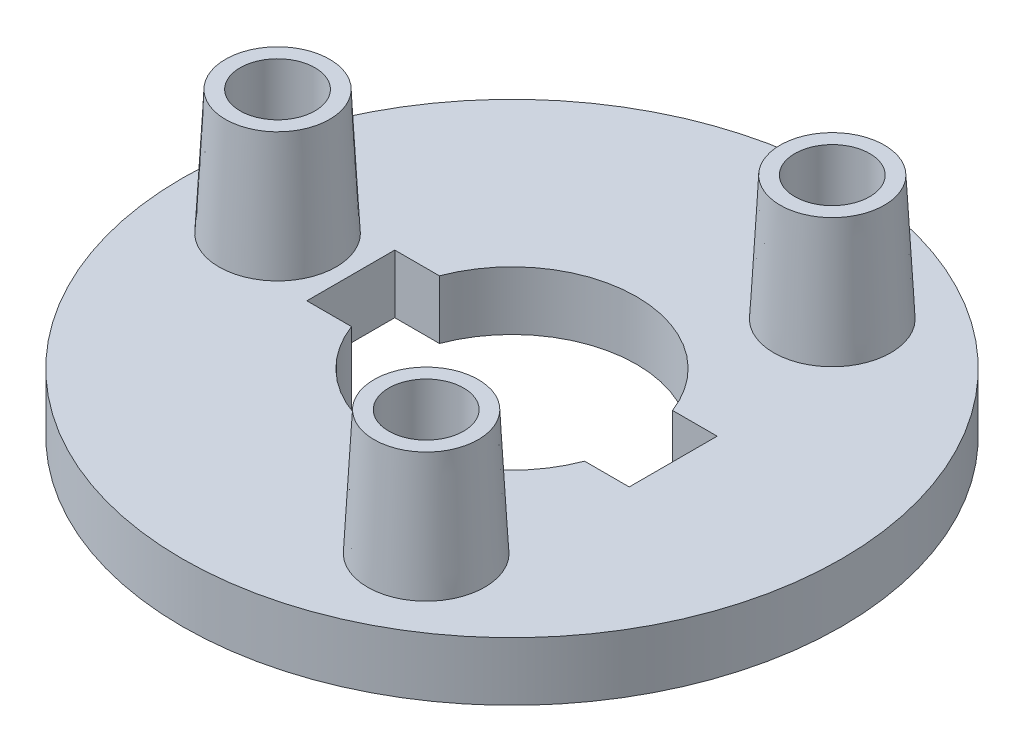
ISO-10303-21;
HEADER;
FILE_DESCRIPTION(('STEP AP214'),'2;1');
FILE_NAME('part.step','',(''),(''),'','','');
FILE_SCHEMA(('AUTOMOTIVE_DESIGN { 1 0 10303 214 1 1 1 1 }'));
ENDSEC;
DATA;
#1=APPLICATION_CONTEXT('core data for automotive mechanical design processes');
#2=APPLICATION_PROTOCOL_DEFINITION('international standard','automotive_design',2000,#1);
#3=PRODUCT_CONTEXT('',#1,'mechanical');
#4=PRODUCT('Part','Part','',(#3));
#5=PRODUCT_RELATED_PRODUCT_CATEGORY('part','',(#4));
#6=PRODUCT_DEFINITION_FORMATION('','',#4);
#7=PRODUCT_DEFINITION_CONTEXT('part definition',#1,'design');
#8=PRODUCT_DEFINITION('design','',#6,#7);
#9=PRODUCT_DEFINITION_SHAPE('','',#8);
#10=(LENGTH_UNIT() NAMED_UNIT(*) SI_UNIT(.MILLI.,.METRE.));
#11=(NAMED_UNIT(*) PLANE_ANGLE_UNIT() SI_UNIT($,.RADIAN.));
#12=(NAMED_UNIT(*) SI_UNIT($,.STERADIAN.) SOLID_ANGLE_UNIT());
#13=UNCERTAINTY_MEASURE_WITH_UNIT(LENGTH_MEASURE(1.E-05),#10,'distance_accuracy_value','');
#14=(GEOMETRIC_REPRESENTATION_CONTEXT(3) GLOBAL_UNCERTAINTY_ASSIGNED_CONTEXT((#13)) GLOBAL_UNIT_ASSIGNED_CONTEXT((#10,
#11,#12)) REPRESENTATION_CONTEXT('',''));
#15=CARTESIAN_POINT('',(0.,0.,0.));
#16=DIRECTION('',(0.,0.,1.));
#17=DIRECTION('',(1.,0.,0.));
#18=AXIS2_PLACEMENT_3D('',#15,#16,#17);
#19=CARTESIAN_POINT('',(8.01004127537005,-8.,-8.32116210434985));
#20=DIRECTION('',(-0.720446935441546,0.,-0.693510067131606));
#21=DIRECTION('',(-0.693510067131606,0.,0.720446935441546));
#22=AXIS2_PLACEMENT_3D('',#19,#20,#21);
#23=PLANE('',#22);
#24=DIRECTION('',(0.,1.,0.));
#25=VECTOR('',#24,1.);
#26=CARTESIAN_POINT('',(8.01004127537005,-8.,-8.32116210434985));
#27=LINE('',#26,#25);
#28=CARTESIAN_POINT('',(8.01004127537005,-5.,-8.32116210434985));
#29=VERTEX_POINT('',#28);
#30=CARTESIAN_POINT('',(8.01004127537005,0.,-8.32116210434985));
#31=VERTEX_POINT('',#30);
#32=EDGE_CURVE('E55',#29,#31,#27,.T.);
#33=ORIENTED_EDGE('',*,*,#32,.F.);
#34=DIRECTION('',(0.693510067131607,0.,-0.720446935441545));
#35=VECTOR('',#34,1.);
#36=CARTESIAN_POINT('',(5.89483557061865,-5.,-6.12379895125314));
#37=LINE('',#36,#35);
#38=CARTESIAN_POINT('',(5.89483557061866,-5.,-6.12379895125314));
#39=VERTEX_POINT('',#38);
#40=EDGE_CURVE('E50',#39,#29,#37,.T.);
#41=ORIENTED_EDGE('',*,*,#40,.F.);
#42=DIRECTION('',(0.,1.,0.));
#43=VECTOR('',#42,1.);
#44=CARTESIAN_POINT('',(5.89483557061866,-8.,-6.12379895125314));
#45=LINE('',#44,#43);
#46=CARTESIAN_POINT('',(5.89483557061866,0.,-6.12379895125314));
#47=VERTEX_POINT('',#46);
#48=EDGE_CURVE('E212',#39,#47,#45,.T.);
#49=ORIENTED_EDGE('',*,*,#48,.T.);
#50=DIRECTION('',(-0.693510067131606,0.,0.720446935441546));
#51=VECTOR('',#50,1.);
#52=CARTESIAN_POINT('',(8.01004127537005,0.,-8.32116210434985));
#53=LINE('',#52,#51);
#54=EDGE_CURVE('E193',#31,#47,#53,.T.);
#55=ORIENTED_EDGE('',*,*,#54,.F.);
#56=EDGE_LOOP('',(#33,#41,#49,#55));
#57=FACE_BOUND('',#56,.T.);
#58=ADVANCED_FACE('F33',(#57),#23,.T.);
#59=CARTESIAN_POINT('',(-8.01004127537005,-8.,8.32116210434985));
#60=DIRECTION('',(0.720446935441546,0.,0.693510067131606));
#61=DIRECTION('',(0.693510067131606,0.,-0.720446935441546));
#62=AXIS2_PLACEMENT_3D('',#59,#60,#61);
#63=PLANE('',#62);
#64=DIRECTION('',(0.,1.,0.));
#65=VECTOR('',#64,1.);
#66=CARTESIAN_POINT('',(-8.01004127537005,-8.,8.32116210434985));
#67=LINE('',#66,#65);
#68=CARTESIAN_POINT('',(-8.01004127537005,-5.,8.32116210434985));
#69=VERTEX_POINT('',#68);
#70=CARTESIAN_POINT('',(-8.01004127537005,0.,8.32116210434985));
#71=VERTEX_POINT('',#70);
#72=EDGE_CURVE('E280',#69,#71,#67,.T.);
#73=ORIENTED_EDGE('',*,*,#72,.F.);
#74=DIRECTION('',(-0.693510067131607,0.,0.720446935441545));
#75=VECTOR('',#74,1.);
#76=CARTESIAN_POINT('',(-5.89483557061865,-5.,6.12379895125314));
#77=LINE('',#76,#75);
#78=CARTESIAN_POINT('',(-5.89483557061866,-5.,6.12379895125314));
#79=VERTEX_POINT('',#78);
#80=EDGE_CURVE('E211',#79,#69,#77,.T.);
#81=ORIENTED_EDGE('',*,*,#80,.F.);
#82=DIRECTION('',(0.,1.,0.));
#83=VECTOR('',#82,1.);
#84=CARTESIAN_POINT('',(-5.89483557061866,-8.,6.12379895125314));
#85=LINE('',#84,#83);
#86=CARTESIAN_POINT('',(-5.89483557061866,0.,6.12379895125314));
#87=VERTEX_POINT('',#86);
#88=EDGE_CURVE('E37',#79,#87,#85,.T.);
#89=ORIENTED_EDGE('',*,*,#88,.T.);
#90=DIRECTION('',(0.693510067131606,0.,-0.720446935441546));
#91=VECTOR('',#90,1.);
#92=CARTESIAN_POINT('',(-8.01004127537005,0.,8.32116210434985));
#93=LINE('',#92,#91);
#94=EDGE_CURVE('E247',#71,#87,#93,.T.);
#95=ORIENTED_EDGE('',*,*,#94,.F.);
#96=EDGE_LOOP('',(#73,#81,#89,#95));
#97=FACE_BOUND('',#96,.T.);
#98=ADVANCED_FACE('F390',(#97),#63,.T.);
#99=CARTESIAN_POINT('',(0.,4.,0.));
#100=DIRECTION('',(0.,1.,0.));
#101=DIRECTION('',(0.,0.,1.));
#102=AXIS2_PLACEMENT_3D('',#99,#100,#101);
#103=PLANE('',#102);
#104=CARTESIAN_POINT('',(7.99999999999987,4.,-13.8564064605511));
#105=DIRECTION('',(0.,1.,0.));
#106=DIRECTION('',(-0.866025403784443,0.,-0.499999999999992));
#107=AXIS2_PLACEMENT_3D('',#104,#105,#106);
#108=CIRCLE('',#107,4.);
#109=CARTESIAN_POINT('',(4.5358983848621,4.,-15.8564064605511));
#110=VERTEX_POINT('',#109);
#111=EDGE_CURVE('E345',#110,#110,#108,.T.);
#112=ORIENTED_EDGE('',*,*,#111,.F.);
#113=EDGE_LOOP('',(#112));
#114=FACE_BOUND('',#113,.T.);
#115=CARTESIAN_POINT('',(8.00000000000007,4.,13.856406460551));
#116=DIRECTION('',(0.,1.,0.));
#117=DIRECTION('',(0.866025403784436,0.,-0.500000000000004));
#118=AXIS2_PLACEMENT_3D('',#115,#116,#117);
#119=CIRCLE('',#118,4.);
#120=CARTESIAN_POINT('',(11.4641016151378,4.,11.856406460551));
#121=VERTEX_POINT('',#120);
#122=EDGE_CURVE('E350',#121,#121,#119,.T.);
#123=ORIENTED_EDGE('',*,*,#122,.F.);
#124=EDGE_LOOP('',(#123));
#125=FACE_BOUND('',#124,.T.);
#126=CARTESIAN_POINT('',(-16.,4.,0.));
#127=DIRECTION('',(0.,1.,0.));
#128=DIRECTION('',(0.,0.,1.));
#129=AXIS2_PLACEMENT_3D('',#126,#127,#128);
#130=CIRCLE('',#129,4.);
#131=CARTESIAN_POINT('',(-16.,4.,4.));
#132=VERTEX_POINT('',#131);
#133=EDGE_CURVE('E357',#132,#132,#130,.T.);
#134=ORIENTED_EDGE('',*,*,#133,.F.);
#135=EDGE_LOOP('',(#134));
#136=FACE_BOUND('',#135,.T.);
#137=CARTESIAN_POINT('',(0.,4.,0.));
#138=DIRECTION('',(0.,1.,0.));
#139=DIRECTION('',(0.,0.,1.));
#140=AXIS2_PLACEMENT_3D('',#137,#138,#139);
#141=CIRCLE('',#140,22.5);
#142=CARTESIAN_POINT('',(0.,4.,22.5));
#143=VERTEX_POINT('',#142);
#144=EDGE_CURVE('E363',#143,#143,#141,.T.);
#145=ORIENTED_EDGE('',*,*,#144,.T.);
#146=EDGE_LOOP('',(#145));
#147=FACE_BOUND('',#146,.T.);
#148=CARTESIAN_POINT('',(0.,4.,0.));
#149=DIRECTION('',(0.,1.,0.));
#150=DIRECTION('',(0.,0.,1.));
#151=AXIS2_PLACEMENT_3D('',#148,#149,#150);
#152=CIRCLE('',#151,8.5);
#153=CARTESIAN_POINT('',(7.95298686029343,4.,-3.));
#154=VERTEX_POINT('',#153);
#155=CARTESIAN_POINT('',(-7.95298686029343,4.,-3.));
#156=VERTEX_POINT('',#155);
#157=EDGE_CURVE('E327',#154,#156,#152,.T.);
#158=ORIENTED_EDGE('',*,*,#157,.F.);
#159=DIRECTION('',(1.,0.,0.));
#160=VECTOR('',#159,1.);
#161=CARTESIAN_POINT('',(-11.,4.,-3.));
#162=LINE('',#161,#160);
#163=CARTESIAN_POINT('',(11.,4.,-3.));
#164=VERTEX_POINT('',#163);
#165=EDGE_CURVE('E286',#154,#164,#162,.T.);
#166=ORIENTED_EDGE('',*,*,#165,.T.);
#167=DIRECTION('',(0.,0.,1.));
#168=VECTOR('',#167,1.);
#169=CARTESIAN_POINT('',(11.,4.,-3.));
#170=LINE('',#169,#168);
#171=CARTESIAN_POINT('',(11.,4.,3.));
#172=VERTEX_POINT('',#171);
#173=EDGE_CURVE('E301',#164,#172,#170,.T.);
#174=ORIENTED_EDGE('',*,*,#173,.T.);
#175=DIRECTION('',(1.,0.,0.));
#176=VECTOR('',#175,1.);
#177=CARTESIAN_POINT('',(-11.,4.,3.));
#178=LINE('',#177,#176);
#179=CARTESIAN_POINT('',(7.95298686029343,4.,3.));
#180=VERTEX_POINT('',#179);
#181=EDGE_CURVE('E267',#180,#172,#178,.T.);
#182=ORIENTED_EDGE('',*,*,#181,.F.);
#183=CARTESIAN_POINT('',(-7.95298686029343,4.,3.));
#184=VERTEX_POINT('',#183);
#185=EDGE_CURVE('E329',#184,#180,#152,.T.);
#186=ORIENTED_EDGE('',*,*,#185,.F.);
#187=DIRECTION('',(1.,0.,0.));
#188=VECTOR('',#187,1.);
#189=CARTESIAN_POINT('',(-11.,4.,3.));
#190=LINE('',#189,#188);
#191=CARTESIAN_POINT('',(-11.,4.,3.));
#192=VERTEX_POINT('',#191);
#193=EDGE_CURVE('E319',#192,#184,#190,.T.);
#194=ORIENTED_EDGE('',*,*,#193,.F.);
#195=DIRECTION('',(0.,0.,1.));
#196=VECTOR('',#195,1.);
#197=CARTESIAN_POINT('',(-11.,4.,-3.));
#198=LINE('',#197,#196);
#199=CARTESIAN_POINT('',(-11.,4.,-3.));
#200=VERTEX_POINT('',#199);
#201=EDGE_CURVE('E316',#200,#192,#198,.T.);
#202=ORIENTED_EDGE('',*,*,#201,.F.);
#203=DIRECTION('',(1.,0.,0.));
#204=VECTOR('',#203,1.);
#205=CARTESIAN_POINT('',(-11.,4.,-3.));
#206=LINE('',#205,#204);
#207=EDGE_CURVE('E321',#200,#156,#206,.T.);
#208=ORIENTED_EDGE('',*,*,#207,.T.);
#209=EDGE_LOOP('',(#158,#166,#174,#182,#186,#194,#202,#208));
#210=FACE_BOUND('',#209,.T.);
#211=ADVANCED_FACE('F396',(#114,#125,#136,#147,#210),#103,.T.);
#212=CARTESIAN_POINT('',(0.,0.,0.));
#213=DIRECTION('',(0.,1.,0.));
#214=DIRECTION('',(0.,0.,1.));
#215=AXIS2_PLACEMENT_3D('',#212,#213,#214);
#216=PLANE('',#215);
#217=CARTESIAN_POINT('',(0.,0.,0.));
#218=DIRECTION('',(0.,1.,0.));
#219=DIRECTION('',(0.,0.,1.));
#220=AXIS2_PLACEMENT_3D('',#217,#218,#219);
#221=CIRCLE('',#220,22.5);
#222=CARTESIAN_POINT('',(0.,0.,22.5));
#223=VERTEX_POINT('',#222);
#224=EDGE_CURVE('E362',#223,#223,#221,.T.);
#225=ORIENTED_EDGE('',*,*,#224,.F.);
#226=EDGE_LOOP('',(#225));
#227=FACE_BOUND('',#226,.T.);
#228=CARTESIAN_POINT('',(-16.,0.,0.));
#229=DIRECTION('',(0.,1.,0.));
#230=DIRECTION('',(0.,0.,1.));
#231=AXIS2_PLACEMENT_3D('',#228,#229,#230);
#232=CIRCLE('',#231,2.55453387609416);
#233=CARTESIAN_POINT('',(-16.,0.,2.55453387609416));
#234=VERTEX_POINT('',#233);
#235=EDGE_CURVE('E354',#234,#234,#232,.T.);
#236=ORIENTED_EDGE('',*,*,#235,.T.);
#237=EDGE_LOOP('',(#236));
#238=FACE_BOUND('',#237,.T.);
#239=CARTESIAN_POINT('',(8.00000000000007,0.,13.856406460551));
#240=DIRECTION('',(0.,1.,0.));
#241=DIRECTION('',(0.866025403784436,0.,-0.500000000000004));
#242=AXIS2_PLACEMENT_3D('',#239,#240,#241);
#243=CIRCLE('',#242,2.55453387609416);
#244=CARTESIAN_POINT('',(10.2122912315255,0.,12.5791395225039));
#245=VERTEX_POINT('',#244);
#246=EDGE_CURVE('E342',#245,#245,#243,.T.);
#247=ORIENTED_EDGE('',*,*,#246,.T.);
#248=EDGE_LOOP('',(#247));
#249=FACE_BOUND('',#248,.T.);
#250=CARTESIAN_POINT('',(7.99999999999987,0.,-13.8564064605511));
#251=DIRECTION('',(0.,1.,0.));
#252=DIRECTION('',(-0.866025403784443,0.,-0.499999999999992));
#253=AXIS2_PLACEMENT_3D('',#250,#251,#252);
#254=CIRCLE('',#253,2.55453387609416);
#255=CARTESIAN_POINT('',(5.78770876847439,0.,-15.1336733985982));
#256=VERTEX_POINT('',#255);
#257=EDGE_CURVE('E336',#256,#256,#254,.T.);
#258=ORIENTED_EDGE('',*,*,#257,.T.);
#259=EDGE_LOOP('',(#258));
#260=FACE_BOUND('',#259,.T.);
#261=CARTESIAN_POINT('',(4.77004454796102,0.,-3.));
#262=DIRECTION('',(0.,1.,0.));
#263=DIRECTION('',(0.,0.,-1.));
#264=AXIS2_PLACEMENT_3D('',#261,#262,#263);
#265=CIRCLE('',#264,6.22995545203898);
#266=CARTESIAN_POINT('',(11.,0.,-3.));
#267=VERTEX_POINT('',#266);
#268=EDGE_CURVE('E190',#267,#31,#265,.T.);
#269=ORIENTED_EDGE('',*,*,#268,.T.);
#270=ORIENTED_EDGE('',*,*,#54,.T.);
#271=CARTESIAN_POINT('',(0.,0.,0.));
#272=DIRECTION('',(0.,1.,0.));
#273=DIRECTION('',(0.,0.,1.));
#274=AXIS2_PLACEMENT_3D('',#271,#272,#273);
#275=CIRCLE('',#274,8.5);
#276=CARTESIAN_POINT('',(-7.95298686029343,0.,-3.));
#277=VERTEX_POINT('',#276);
#278=EDGE_CURVE('E331',#277,#47,#275,.F.);
#279=ORIENTED_EDGE('',*,*,#278,.F.);
#280=DIRECTION('',(-1.,0.,0.));
#281=VECTOR('',#280,1.);
#282=CARTESIAN_POINT('',(-11.,0.,-3.));
#283=LINE('',#282,#281);
#284=CARTESIAN_POINT('',(-11.,0.,-3.));
#285=VERTEX_POINT('',#284);
#286=EDGE_CURVE('E313',#277,#285,#283,.T.);
#287=ORIENTED_EDGE('',*,*,#286,.T.);
#288=DIRECTION('',(0.,0.,-1.));
#289=VECTOR('',#288,1.);
#290=CARTESIAN_POINT('',(-11.,0.,-3.));
#291=LINE('',#290,#289);
#292=CARTESIAN_POINT('',(-11.,0.,3.));
#293=VERTEX_POINT('',#292);
#294=EDGE_CURVE('E310',#293,#285,#291,.T.);
#295=ORIENTED_EDGE('',*,*,#294,.F.);
#296=CARTESIAN_POINT('',(-4.77004454796102,0.,3.));
#297=DIRECTION('',(0.,1.,0.));
#298=DIRECTION('',(0.,0.,1.));
#299=AXIS2_PLACEMENT_3D('',#296,#297,#298);
#300=CIRCLE('',#299,6.22995545203898);
#301=EDGE_CURVE('E242',#293,#71,#300,.T.);
#302=ORIENTED_EDGE('',*,*,#301,.T.);
#303=ORIENTED_EDGE('',*,*,#94,.T.);
#304=CARTESIAN_POINT('',(7.95298686029343,0.,3.));
#305=VERTEX_POINT('',#304);
#306=EDGE_CURVE('E263',#305,#87,#275,.F.);
#307=ORIENTED_EDGE('',*,*,#306,.F.);
#308=DIRECTION('',(-1.,0.,0.));
#309=VECTOR('',#308,1.);
#310=CARTESIAN_POINT('',(-11.,0.,3.));
#311=LINE('',#310,#309);
#312=CARTESIAN_POINT('',(11.,0.,3.));
#313=VERTEX_POINT('',#312);
#314=EDGE_CURVE('E291',#313,#305,#311,.T.);
#315=ORIENTED_EDGE('',*,*,#314,.F.);
#316=DIRECTION('',(0.,0.,-1.));
#317=VECTOR('',#316,1.);
#318=CARTESIAN_POINT('',(11.,0.,-3.));
#319=LINE('',#318,#317);
#320=EDGE_CURVE('E290',#313,#267,#319,.T.);
#321=ORIENTED_EDGE('',*,*,#320,.T.);
#322=EDGE_LOOP('',(#269,#270,#279,#287,#295,#302,#303,#307,#315,#321));
#323=FACE_BOUND('',#322,.T.);
#324=ADVANCED_FACE('F478',(#227,#238,#249,#260,#323),#216,.F.);
#325=CARTESIAN_POINT('',(0.,-0.00100000000000013,0.));
#326=DIRECTION('',(0.,1.,0.));
#327=DIRECTION('',(0.,0.,1.));
#328=AXIS2_PLACEMENT_3D('',#325,#326,#327);
#329=CYLINDRICAL_SURFACE('',#328,8.5);
#330=DIRECTION('',(0.,1.,0.));
#331=VECTOR('',#330,1.);
#332=CARTESIAN_POINT('',(7.95298686029343,-0.00100000000000013,-3.));
#333=LINE('',#332,#331);
#334=CARTESIAN_POINT('',(7.95298686029343,-8.,-3.));
#335=VERTEX_POINT('',#334);
#336=EDGE_CURVE('E289',#335,#154,#333,.T.);
#337=ORIENTED_EDGE('',*,*,#336,.T.);
#338=ORIENTED_EDGE('',*,*,#157,.T.);
#339=DIRECTION('',(0.,1.,0.));
#340=VECTOR('',#339,1.);
#341=CARTESIAN_POINT('',(-7.95298686029343,-0.00100000000000013,-3.));
#342=LINE('',#341,#340);
#343=EDGE_CURVE('E307',#156,#277,#342,.F.);
#344=ORIENTED_EDGE('',*,*,#343,.T.);
#345=ORIENTED_EDGE('',*,*,#278,.T.);
#346=ORIENTED_EDGE('',*,*,#48,.F.);
#347=CARTESIAN_POINT('',(5.89483557061865,-8.,-6.12379895125314));
#348=VERTEX_POINT('',#347);
#349=EDGE_CURVE('E189',#348,#39,#45,.T.);
#350=ORIENTED_EDGE('',*,*,#349,.F.);
#351=CARTESIAN_POINT('',(0.,-8.,0.));
#352=DIRECTION('',(0.,-1.,0.));
#353=DIRECTION('',(0.,0.,1.));
#354=AXIS2_PLACEMENT_3D('',#351,#352,#353);
#355=CIRCLE('',#354,8.50000000000004);
#356=EDGE_CURVE('E199',#348,#335,#355,.T.);
#357=ORIENTED_EDGE('',*,*,#356,.T.);
#358=EDGE_LOOP('',(#337,#338,#344,#345,#346,#350,#357));
#359=FACE_BOUND('',#358,.T.);
#360=ADVANCED_FACE('F456',(#359),#329,.F.);
#361=CARTESIAN_POINT('',(0.,4.,0.));
#362=DIRECTION('',(0.,-1.,0.));
#363=DIRECTION('',(0.,0.,-1.));
#364=AXIS2_PLACEMENT_3D('',#361,#362,#363);
#365=CYLINDRICAL_SURFACE('',#364,22.5);
#366=ORIENTED_EDGE('',*,*,#144,.F.);
#367=EDGE_LOOP('',(#366));
#368=FACE_BOUND('',#367,.T.);
#369=ORIENTED_EDGE('',*,*,#224,.T.);
#370=EDGE_LOOP('',(#369));
#371=FACE_BOUND('',#370,.T.);
#372=ADVANCED_FACE('F474',(#368,#371),#365,.T.);
#373=CARTESIAN_POINT('',(-16.,12.5,0.));
#374=DIRECTION('',(0.,1.,0.));
#375=DIRECTION('',(0.,0.,1.));
#376=AXIS2_PLACEMENT_3D('',#373,#374,#375);
#377=PLANE('',#376);
#378=CARTESIAN_POINT('',(-16.,12.5,0.));
#379=DIRECTION('',(0.,1.,0.));
#380=DIRECTION('',(0.,0.,1.));
#381=AXIS2_PLACEMENT_3D('',#378,#379,#380);
#382=CIRCLE('',#381,2.55453387609416);
#383=CARTESIAN_POINT('',(-16.,12.5,2.55453387609416));
#384=VERTEX_POINT('',#383);
#385=EDGE_CURVE('E353',#384,#384,#382,.T.);
#386=ORIENTED_EDGE('',*,*,#385,.F.);
#387=EDGE_LOOP('',(#386));
#388=FACE_BOUND('',#387,.T.);
#389=CARTESIAN_POINT('',(-16.,12.5,0.));
#390=DIRECTION('',(0.,1.,0.));
#391=DIRECTION('',(0.,0.,1.));
#392=AXIS2_PLACEMENT_3D('',#389,#390,#391);
#393=CIRCLE('',#392,3.55453387609416);
#394=CARTESIAN_POINT('',(-16.,12.5,3.55453387609416));
#395=VERTEX_POINT('',#394);
#396=EDGE_CURVE('E366',#395,#395,#393,.T.);
#397=ORIENTED_EDGE('',*,*,#396,.T.);
#398=EDGE_LOOP('',(#397));
#399=FACE_BOUND('',#398,.T.);
#400=ADVANCED_FACE('F471',(#388,#399),#377,.T.);
#401=CARTESIAN_POINT('',(-16.,12.5,0.));
#402=DIRECTION('',(0.,-1.,0.));
#403=DIRECTION('',(0.,0.,-1.));
#404=AXIS2_PLACEMENT_3D('',#401,#402,#403);
#405=CONICAL_SURFACE('',#404,3.55453387609416,0.0523598775598265);
#406=ORIENTED_EDGE('',*,*,#133,.T.);
#407=EDGE_LOOP('',(#406));
#408=FACE_BOUND('',#407,.T.);
#409=ORIENTED_EDGE('',*,*,#396,.F.);
#410=EDGE_LOOP('',(#409));
#411=FACE_BOUND('',#410,.T.);
#412=ADVANCED_FACE('F469',(#408,#411),#405,.T.);
#413=CARTESIAN_POINT('',(-16.,0.,0.));
#414=DIRECTION('',(0.,1.,0.));
#415=DIRECTION('',(0.,0.,1.));
#416=AXIS2_PLACEMENT_3D('',#413,#414,#415);
#417=CYLINDRICAL_SURFACE('',#416,2.55453387609416);
#418=ORIENTED_EDGE('',*,*,#235,.F.);
#419=EDGE_LOOP('',(#418));
#420=FACE_BOUND('',#419,.T.);
#421=ORIENTED_EDGE('',*,*,#385,.T.);
#422=EDGE_LOOP('',(#421));
#423=FACE_BOUND('',#422,.T.);
#424=ADVANCED_FACE('F465',(#420,#423),#417,.F.);
#425=CARTESIAN_POINT('',(8.00000000000007,12.5,13.856406460551));
#426=DIRECTION('',(0.,1.,0.));
#427=DIRECTION('',(0.866025403784436,0.,-0.500000000000004));
#428=AXIS2_PLACEMENT_3D('',#425,#426,#427);
#429=PLANE('',#428);
#430=CARTESIAN_POINT('',(8.00000000000007,12.5,13.856406460551));
#431=DIRECTION('',(0.,1.,0.));
#432=DIRECTION('',(0.866025403784436,0.,-0.500000000000004));
#433=AXIS2_PLACEMENT_3D('',#430,#431,#432);
#434=CIRCLE('',#433,2.55453387609416);
#435=CARTESIAN_POINT('',(10.2122912315255,12.5,12.5791395225039));
#436=VERTEX_POINT('',#435);
#437=EDGE_CURVE('E339',#436,#436,#434,.T.);
#438=ORIENTED_EDGE('',*,*,#437,.F.);
#439=EDGE_LOOP('',(#438));
#440=FACE_BOUND('',#439,.T.);
#441=CARTESIAN_POINT('',(8.00000000000007,12.5,13.856406460551));
#442=DIRECTION('',(0.,1.,0.));
#443=DIRECTION('',(0.,0.,1.));
#444=AXIS2_PLACEMENT_3D('',#441,#442,#443);
#445=CIRCLE('',#444,3.55453387609417);
#446=CARTESIAN_POINT('',(8.00000000000007,12.5,17.4109403366452));
#447=VERTEX_POINT('',#446);
#448=EDGE_CURVE('E42',#447,#447,#445,.T.);
#449=ORIENTED_EDGE('',*,*,#448,.T.);
#450=EDGE_LOOP('',(#449));
#451=FACE_BOUND('',#450,.T.);
#452=ADVANCED_FACE('F374',(#440,#451),#429,.T.);
#453=CARTESIAN_POINT('',(7.99999999999987,12.5,-13.8564064605511));
#454=DIRECTION('',(0.,1.,0.));
#455=DIRECTION('',(-0.866025403784443,0.,-0.499999999999992));
#456=AXIS2_PLACEMENT_3D('',#453,#454,#455);
#457=PLANE('',#456);
#458=CARTESIAN_POINT('',(7.99999999999987,12.5,-13.8564064605511));
#459=DIRECTION('',(0.,1.,0.));
#460=DIRECTION('',(-0.866025403784443,0.,-0.499999999999992));
#461=AXIS2_PLACEMENT_3D('',#458,#459,#460);
#462=CIRCLE('',#461,2.55453387609416);
#463=CARTESIAN_POINT('',(5.78770876847439,12.5,-15.1336733985982));
#464=VERTEX_POINT('',#463);
#465=EDGE_CURVE('E335',#464,#464,#462,.T.);
#466=ORIENTED_EDGE('',*,*,#465,.F.);
#467=EDGE_LOOP('',(#466));
#468=FACE_BOUND('',#467,.T.);
#469=CARTESIAN_POINT('',(7.99999999999987,12.5,-13.8564064605511));
#470=DIRECTION('',(0.,1.,0.));
#471=DIRECTION('',(0.,0.,1.));
#472=AXIS2_PLACEMENT_3D('',#469,#470,#471);
#473=CIRCLE('',#472,3.55453387609416);
#474=CARTESIAN_POINT('',(7.99999999999987,12.5,-10.3018725844569));
#475=VERTEX_POINT('',#474);
#476=EDGE_CURVE('E11',#475,#475,#473,.T.);
#477=ORIENTED_EDGE('',*,*,#476,.T.);
#478=EDGE_LOOP('',(#477));
#479=FACE_BOUND('',#478,.T.);
#480=ADVANCED_FACE('F378',(#468,#479),#457,.T.);
#481=CARTESIAN_POINT('',(8.00000000000007,12.5,13.856406460551));
#482=DIRECTION('',(0.,-1.,0.));
#483=DIRECTION('',(0.,0.,-1.));
#484=AXIS2_PLACEMENT_3D('',#481,#482,#483);
#485=CONICAL_SURFACE('',#484,3.55453387609417,0.0523598775598265);
#486=ORIENTED_EDGE('',*,*,#122,.T.);
#487=EDGE_LOOP('',(#486));
#488=FACE_BOUND('',#487,.T.);
#489=ORIENTED_EDGE('',*,*,#448,.F.);
#490=EDGE_LOOP('',(#489));
#491=FACE_BOUND('',#490,.T.);
#492=ADVANCED_FACE('F376',(#488,#491),#485,.T.);
#493=CARTESIAN_POINT('',(7.99999999999987,12.5,-13.8564064605511));
#494=DIRECTION('',(0.,-1.,0.));
#495=DIRECTION('',(0.,0.,-1.));
#496=AXIS2_PLACEMENT_3D('',#493,#494,#495);
#497=CONICAL_SURFACE('',#496,3.55453387609416,0.0523598775598267);
#498=ORIENTED_EDGE('',*,*,#111,.T.);
#499=EDGE_LOOP('',(#498));
#500=FACE_BOUND('',#499,.T.);
#501=ORIENTED_EDGE('',*,*,#476,.F.);
#502=EDGE_LOOP('',(#501));
#503=FACE_BOUND('',#502,.T.);
#504=ADVANCED_FACE('F35',(#500,#503),#497,.T.);
#505=CARTESIAN_POINT('',(8.00000000000007,0.,13.856406460551));
#506=DIRECTION('',(0.,1.,0.));
#507=DIRECTION('',(0.,0.,1.));
#508=AXIS2_PLACEMENT_3D('',#505,#506,#507);
#509=CYLINDRICAL_SURFACE('',#508,2.55453387609416);
#510=ORIENTED_EDGE('',*,*,#246,.F.);
#511=EDGE_LOOP('',(#510));
#512=FACE_BOUND('',#511,.T.);
#513=ORIENTED_EDGE('',*,*,#437,.T.);
#514=EDGE_LOOP('',(#513));
#515=FACE_BOUND('',#514,.T.);
#516=ADVANCED_FACE('F384',(#512,#515),#509,.F.);
#517=CARTESIAN_POINT('',(7.99999999999987,0.,-13.8564064605511));
#518=DIRECTION('',(0.,1.,0.));
#519=DIRECTION('',(0.,0.,1.));
#520=AXIS2_PLACEMENT_3D('',#517,#518,#519);
#521=CYLINDRICAL_SURFACE('',#520,2.55453387609416);
#522=ORIENTED_EDGE('',*,*,#257,.F.);
#523=EDGE_LOOP('',(#522));
#524=FACE_BOUND('',#523,.T.);
#525=ORIENTED_EDGE('',*,*,#465,.T.);
#526=EDGE_LOOP('',(#525));
#527=FACE_BOUND('',#526,.T.);
#528=ADVANCED_FACE('F454',(#524,#527),#521,.F.);
#529=ORIENTED_EDGE('',*,*,#185,.T.);
#530=DIRECTION('',(0.,1.,0.));
#531=VECTOR('',#530,1.);
#532=CARTESIAN_POINT('',(7.95298686029343,-0.00100000000000013,3.));
#533=LINE('',#532,#531);
#534=EDGE_CURVE('E294',#305,#180,#533,.T.);
#535=ORIENTED_EDGE('',*,*,#534,.F.);
#536=ORIENTED_EDGE('',*,*,#306,.T.);
#537=ORIENTED_EDGE('',*,*,#88,.F.);
#538=CARTESIAN_POINT('',(-5.89483557061865,-8.,6.12379895125314));
#539=VERTEX_POINT('',#538);
#540=EDGE_CURVE('E265',#539,#79,#85,.T.);
#541=ORIENTED_EDGE('',*,*,#540,.F.);
#542=CARTESIAN_POINT('',(0.,-8.,0.));
#543=DIRECTION('',(0.,-1.,0.));
#544=DIRECTION('',(0.,0.,-1.));
#545=AXIS2_PLACEMENT_3D('',#542,#543,#544);
#546=CIRCLE('',#545,8.50000000000004);
#547=CARTESIAN_POINT('',(-7.95298686029343,-8.,3.));
#548=VERTEX_POINT('',#547);
#549=EDGE_CURVE('E243',#539,#548,#546,.T.);
#550=ORIENTED_EDGE('',*,*,#549,.T.);
#551=DIRECTION('',(0.,1.,0.));
#552=VECTOR('',#551,1.);
#553=CARTESIAN_POINT('',(-7.95298686029343,-0.00100000000000013,3.));
#554=LINE('',#553,#552);
#555=EDGE_CURVE('E293',#184,#548,#554,.F.);
#556=ORIENTED_EDGE('',*,*,#555,.F.);
#557=EDGE_LOOP('',(#529,#535,#536,#537,#541,#550,#556));
#558=FACE_BOUND('',#557,.T.);
#559=ADVANCED_FACE('F448',(#558),#329,.F.);
#560=CARTESIAN_POINT('',(-11.,-0.00100000000000013,3.));
#561=DIRECTION('',(0.,0.,1.));
#562=DIRECTION('',(1.,0.,0.));
#563=AXIS2_PLACEMENT_3D('',#560,#561,#562);
#564=PLANE('',#563);
#565=ORIENTED_EDGE('',*,*,#555,.T.);
#566=DIRECTION('',(-1.,0.,0.));
#567=VECTOR('',#566,1.);
#568=CARTESIAN_POINT('',(-7.95298686029343,-8.,3.));
#569=LINE('',#568,#567);
#570=CARTESIAN_POINT('',(-11.,-8.,3.));
#571=VERTEX_POINT('',#570);
#572=EDGE_CURVE('E246',#548,#571,#569,.T.);
#573=ORIENTED_EDGE('',*,*,#572,.T.);
#574=DIRECTION('',(0.,1.,0.));
#575=VECTOR('',#574,1.);
#576=CARTESIAN_POINT('',(-11.,-8.,3.));
#577=LINE('',#576,#575);
#578=EDGE_CURVE('E252',#571,#293,#577,.T.);
#579=ORIENTED_EDGE('',*,*,#578,.T.);
#580=DIRECTION('',(0.,1.,0.));
#581=VECTOR('',#580,1.);
#582=CARTESIAN_POINT('',(-11.,-0.00100000000000013,3.));
#583=LINE('',#582,#581);
#584=EDGE_CURVE('E324',#293,#192,#583,.T.);
#585=ORIENTED_EDGE('',*,*,#584,.T.);
#586=ORIENTED_EDGE('',*,*,#193,.T.);
#587=EDGE_LOOP('',(#565,#573,#579,#585,#586));
#588=FACE_BOUND('',#587,.T.);
#589=ADVANCED_FACE('F444',(#588),#564,.F.);
#590=CARTESIAN_POINT('',(-11.,-0.00100000000000013,-3.));
#591=DIRECTION('',(0.,0.,1.));
#592=DIRECTION('',(1.,0.,0.));
#593=AXIS2_PLACEMENT_3D('',#590,#591,#592);
#594=PLANE('',#593);
#595=ORIENTED_EDGE('',*,*,#343,.F.);
#596=ORIENTED_EDGE('',*,*,#207,.F.);
#597=DIRECTION('',(0.,1.,0.));
#598=VECTOR('',#597,1.);
#599=CARTESIAN_POINT('',(-11.,-0.00100000000000013,-3.));
#600=LINE('',#599,#598);
#601=EDGE_CURVE('E325',#285,#200,#600,.T.);
#602=ORIENTED_EDGE('',*,*,#601,.F.);
#603=ORIENTED_EDGE('',*,*,#286,.F.);
#604=EDGE_LOOP('',(#595,#596,#602,#603));
#605=FACE_BOUND('',#604,.T.);
#606=ADVANCED_FACE('F441',(#605),#594,.T.);
#607=CARTESIAN_POINT('',(-11.,-0.00100000000000013,-3.));
#608=DIRECTION('',(-1.,0.,0.));
#609=DIRECTION('',(0.,0.,1.));
#610=AXIS2_PLACEMENT_3D('',#607,#608,#609);
#611=PLANE('',#610);
#612=ORIENTED_EDGE('',*,*,#294,.T.);
#613=ORIENTED_EDGE('',*,*,#601,.T.);
#614=ORIENTED_EDGE('',*,*,#201,.T.);
#615=ORIENTED_EDGE('',*,*,#584,.F.);
#616=EDGE_LOOP('',(#612,#613,#614,#615));
#617=FACE_BOUND('',#616,.T.);
#618=ADVANCED_FACE('F433',(#617),#611,.F.);
#619=CARTESIAN_POINT('',(-11.,-0.00100000000000013,-3.));
#620=DIRECTION('',(0.,0.,1.));
#621=DIRECTION('',(1.,0.,0.));
#622=AXIS2_PLACEMENT_3D('',#619,#620,#621);
#623=PLANE('',#622);
#624=DIRECTION('',(0.,1.,0.));
#625=VECTOR('',#624,1.);
#626=CARTESIAN_POINT('',(11.,-0.00100000000000013,-3.));
#627=LINE('',#626,#625);
#628=EDGE_CURVE('E300',#267,#164,#627,.T.);
#629=ORIENTED_EDGE('',*,*,#628,.T.);
#630=ORIENTED_EDGE('',*,*,#165,.F.);
#631=ORIENTED_EDGE('',*,*,#336,.F.);
#632=DIRECTION('',(1.,0.,0.));
#633=VECTOR('',#632,1.);
#634=CARTESIAN_POINT('',(7.95298686029343,-8.,-3.));
#635=LINE('',#634,#633);
#636=CARTESIAN_POINT('',(11.,-8.,-3.));
#637=VERTEX_POINT('',#636);
#638=EDGE_CURVE('E202',#335,#637,#635,.T.);
#639=ORIENTED_EDGE('',*,*,#638,.T.);
#640=DIRECTION('',(0.,1.,0.));
#641=VECTOR('',#640,1.);
#642=CARTESIAN_POINT('',(11.,-8.,-3.));
#643=LINE('',#642,#641);
#644=EDGE_CURVE('E206',#637,#267,#643,.T.);
#645=ORIENTED_EDGE('',*,*,#644,.T.);
#646=EDGE_LOOP('',(#629,#630,#631,#639,#645));
#647=FACE_BOUND('',#646,.T.);
#648=ADVANCED_FACE('F429',(#647),#623,.T.);
#649=CARTESIAN_POINT('',(11.,-0.00100000000000013,-3.));
#650=DIRECTION('',(-1.,0.,0.));
#651=DIRECTION('',(0.,0.,1.));
#652=AXIS2_PLACEMENT_3D('',#649,#650,#651);
#653=PLANE('',#652);
#654=DIRECTION('',(0.,1.,0.));
#655=VECTOR('',#654,1.);
#656=CARTESIAN_POINT('',(11.,-0.00100000000000013,3.));
#657=LINE('',#656,#655);
#658=EDGE_CURVE('E274',#313,#172,#657,.T.);
#659=ORIENTED_EDGE('',*,*,#658,.T.);
#660=ORIENTED_EDGE('',*,*,#173,.F.);
#661=ORIENTED_EDGE('',*,*,#628,.F.);
#662=ORIENTED_EDGE('',*,*,#320,.F.);
#663=EDGE_LOOP('',(#659,#660,#661,#662));
#664=FACE_BOUND('',#663,.T.);
#665=ADVANCED_FACE('F432',(#664),#653,.T.);
#666=CARTESIAN_POINT('',(-11.,-0.00100000000000013,3.));
#667=DIRECTION('',(0.,0.,1.));
#668=DIRECTION('',(1.,0.,0.));
#669=AXIS2_PLACEMENT_3D('',#666,#667,#668);
#670=PLANE('',#669);
#671=ORIENTED_EDGE('',*,*,#314,.T.);
#672=ORIENTED_EDGE('',*,*,#534,.T.);
#673=ORIENTED_EDGE('',*,*,#181,.T.);
#674=ORIENTED_EDGE('',*,*,#658,.F.);
#675=EDGE_LOOP('',(#671,#672,#673,#674));
#676=FACE_BOUND('',#675,.T.);
#677=ADVANCED_FACE('F428',(#676),#670,.F.);
#678=CARTESIAN_POINT('',(-4.77004454796102,-8.,3.));
#679=DIRECTION('',(0.,1.,0.));
#680=DIRECTION('',(0.,0.,1.));
#681=AXIS2_PLACEMENT_3D('',#678,#679,#680);
#682=CYLINDRICAL_SURFACE('',#681,6.22995545203898);
#683=ORIENTED_EDGE('',*,*,#301,.F.);
#684=ORIENTED_EDGE('',*,*,#578,.F.);
#685=CARTESIAN_POINT('',(-4.77004454796102,-8.,3.));
#686=DIRECTION('',(0.,1.,0.));
#687=DIRECTION('',(0.,0.,1.));
#688=AXIS2_PLACEMENT_3D('',#685,#686,#687);
#689=CIRCLE('',#688,6.22995545203898);
#690=CARTESIAN_POINT('',(-8.01004127537005,-8.,8.32116210434985));
#691=VERTEX_POINT('',#690);
#692=EDGE_CURVE('E250',#571,#691,#689,.T.);
#693=ORIENTED_EDGE('',*,*,#692,.T.);
#694=EDGE_CURVE('E257',#691,#69,#67,.T.);
#695=ORIENTED_EDGE('',*,*,#694,.T.);
#696=ORIENTED_EDGE('',*,*,#72,.T.);
#697=EDGE_LOOP('',(#683,#684,#693,#695,#696));
#698=FACE_BOUND('',#697,.T.);
#699=ADVANCED_FACE('F423',(#698),#682,.T.);
#700=CARTESIAN_POINT('',(0.,-8.,0.));
#701=DIRECTION('',(0.,-1.,0.));
#702=DIRECTION('',(0.,0.,-1.));
#703=AXIS2_PLACEMENT_3D('',#700,#701,#702);
#704=PLANE('',#703);
#705=ORIENTED_EDGE('',*,*,#549,.F.);
#706=DIRECTION('',(-0.720446935441546,0.,-0.693510067131606));
#707=VECTOR('',#706,1.);
#708=CARTESIAN_POINT('',(-2.29260089341092,-8.,9.59134928691117));
#709=LINE('',#708,#707);
#710=CARTESIAN_POINT('',(-2.29260089341092,-8.,9.59134928691117));
#711=VERTEX_POINT('',#710);
#712=EDGE_CURVE('E228',#711,#539,#709,.T.);
#713=ORIENTED_EDGE('',*,*,#712,.F.);
#714=DIRECTION('',(-0.693510067131607,0.,0.720446935441545));
#715=VECTOR('',#714,1.);
#716=CARTESIAN_POINT('',(-2.29260089341092,-8.,9.59134928691117));
#717=LINE('',#716,#715);
#718=CARTESIAN_POINT('',(-4.40780659816232,-8.,11.7887124400079));
#719=VERTEX_POINT('',#718);
#720=EDGE_CURVE('E225',#711,#719,#717,.T.);
#721=ORIENTED_EDGE('',*,*,#720,.T.);
#722=DIRECTION('',(-0.720446935441546,0.,-0.693510067131606));
#723=VECTOR('',#722,1.);
#724=CARTESIAN_POINT('',(-4.40780659816232,-8.,11.7887124400079));
#725=LINE('',#724,#723);
#726=EDGE_CURVE('E233',#719,#691,#725,.T.);
#727=ORIENTED_EDGE('',*,*,#726,.T.);
#728=ORIENTED_EDGE('',*,*,#692,.F.);
#729=ORIENTED_EDGE('',*,*,#572,.F.);
#730=EDGE_LOOP('',(#705,#713,#721,#727,#728,#729));
#731=FACE_BOUND('',#730,.T.);
#732=ADVANCED_FACE('F421',(#731),#704,.T.);
#733=CARTESIAN_POINT('',(-2.29260089341092,-8.,9.59134928691117));
#734=DIRECTION('',(-0.693510067131606,0.,0.720446935441546));
#735=DIRECTION('',(0.720446935441546,0.,0.693510067131606));
#736=AXIS2_PLACEMENT_3D('',#733,#734,#735);
#737=PLANE('',#736);
#738=ORIENTED_EDGE('',*,*,#540,.T.);
#739=DIRECTION('',(-0.720446935441546,0.,-0.693510067131606));
#740=VECTOR('',#739,1.);
#741=CARTESIAN_POINT('',(-2.29260089341092,-5.,9.59134928691117));
#742=LINE('',#741,#740);
#743=CARTESIAN_POINT('',(-2.29260089341092,-5.,9.59134928691117));
#744=VERTEX_POINT('',#743);
#745=EDGE_CURVE('E239',#744,#79,#742,.T.);
#746=ORIENTED_EDGE('',*,*,#745,.F.);
#747=DIRECTION('',(0.,1.,0.));
#748=VECTOR('',#747,1.);
#749=CARTESIAN_POINT('',(-2.29260089341092,-8.,9.59134928691117));
#750=LINE('',#749,#748);
#751=EDGE_CURVE('E217',#711,#744,#750,.T.);
#752=ORIENTED_EDGE('',*,*,#751,.F.);
#753=ORIENTED_EDGE('',*,*,#712,.T.);
#754=EDGE_LOOP('',(#738,#746,#752,#753));
#755=FACE_BOUND('',#754,.T.);
#756=ADVANCED_FACE('F417',(#755),#737,.F.);
#757=CARTESIAN_POINT('',(-2.29260089341092,-5.,9.59134928691117));
#758=DIRECTION('',(0.,-1.,0.));
#759=DIRECTION('',(0.,0.,-1.));
#760=AXIS2_PLACEMENT_3D('',#757,#758,#759);
#761=PLANE('',#760);
#762=ORIENTED_EDGE('',*,*,#80,.T.);
#763=DIRECTION('',(-0.720446935441546,0.,-0.693510067131606));
#764=VECTOR('',#763,1.);
#765=CARTESIAN_POINT('',(-4.40780659816232,-5.,11.7887124400079));
#766=LINE('',#765,#764);
#767=CARTESIAN_POINT('',(-4.40780659816232,-5.,11.7887124400079));
#768=VERTEX_POINT('',#767);
#769=EDGE_CURVE('E236',#768,#69,#766,.T.);
#770=ORIENTED_EDGE('',*,*,#769,.F.);
#771=DIRECTION('',(-0.693510067131607,0.,0.720446935441545));
#772=VECTOR('',#771,1.);
#773=CARTESIAN_POINT('',(-2.29260089341092,-5.,9.59134928691117));
#774=LINE('',#773,#772);
#775=EDGE_CURVE('E220',#744,#768,#774,.T.);
#776=ORIENTED_EDGE('',*,*,#775,.F.);
#777=ORIENTED_EDGE('',*,*,#745,.T.);
#778=EDGE_LOOP('',(#762,#770,#776,#777));
#779=FACE_BOUND('',#778,.T.);
#780=ADVANCED_FACE('F413',(#779),#761,.F.);
#781=CARTESIAN_POINT('',(-4.40780659816232,-8.,11.7887124400079));
#782=DIRECTION('',(-0.693510067131606,0.,0.720446935441546));
#783=DIRECTION('',(0.720446935441546,0.,0.693510067131606));
#784=AXIS2_PLACEMENT_3D('',#781,#782,#783);
#785=PLANE('',#784);
#786=ORIENTED_EDGE('',*,*,#694,.F.);
#787=ORIENTED_EDGE('',*,*,#726,.F.);
#788=DIRECTION('',(0.,1.,0.));
#789=VECTOR('',#788,1.);
#790=CARTESIAN_POINT('',(-4.40780659816232,-8.,11.7887124400079));
#791=LINE('',#790,#789);
#792=EDGE_CURVE('E222',#719,#768,#791,.T.);
#793=ORIENTED_EDGE('',*,*,#792,.T.);
#794=ORIENTED_EDGE('',*,*,#769,.T.);
#795=EDGE_LOOP('',(#786,#787,#793,#794));
#796=FACE_BOUND('',#795,.T.);
#797=ADVANCED_FACE('F409',(#796),#785,.T.);
#798=CARTESIAN_POINT('',(3.60223467720773,0.,3.46755033565803));
#799=DIRECTION('',(0.720446935441545,0.,0.693510067131607));
#800=DIRECTION('',(0.693510067131607,0.,-0.720446935441545));
#801=AXIS2_PLACEMENT_3D('',#798,#799,#800);
#802=PLANE('',#801);
#803=ORIENTED_EDGE('',*,*,#751,.T.);
#804=ORIENTED_EDGE('',*,*,#775,.T.);
#805=ORIENTED_EDGE('',*,*,#792,.F.);
#806=ORIENTED_EDGE('',*,*,#720,.F.);
#807=EDGE_LOOP('',(#803,#804,#805,#806));
#808=FACE_BOUND('',#807,.T.);
#809=ADVANCED_FACE('F405',(#808),#802,.T.);
#810=CARTESIAN_POINT('',(4.77004454796102,-8.,-3.));
#811=DIRECTION('',(0.,1.,0.));
#812=DIRECTION('',(0.,0.,1.));
#813=AXIS2_PLACEMENT_3D('',#810,#811,#812);
#814=CYLINDRICAL_SURFACE('',#813,6.22995545203898);
#815=ORIENTED_EDGE('',*,*,#268,.F.);
#816=ORIENTED_EDGE('',*,*,#644,.F.);
#817=CARTESIAN_POINT('',(4.77004454796102,-8.,-3.));
#818=DIRECTION('',(0.,1.,0.));
#819=DIRECTION('',(0.,0.,-1.));
#820=AXIS2_PLACEMENT_3D('',#817,#818,#819);
#821=CIRCLE('',#820,6.22995545203898);
#822=CARTESIAN_POINT('',(8.01004127537005,-8.,-8.32116210434985));
#823=VERTEX_POINT('',#822);
#824=EDGE_CURVE('E205',#637,#823,#821,.T.);
#825=ORIENTED_EDGE('',*,*,#824,.T.);
#826=EDGE_CURVE('E213',#823,#29,#27,.T.);
#827=ORIENTED_EDGE('',*,*,#826,.T.);
#828=ORIENTED_EDGE('',*,*,#32,.T.);
#829=EDGE_LOOP('',(#815,#816,#825,#827,#828));
#830=FACE_BOUND('',#829,.T.);
#831=ADVANCED_FACE('F402',(#830),#814,.T.);
#832=CARTESIAN_POINT('',(0.,-8.,0.));
#833=DIRECTION('',(0.,-1.,0.));
#834=DIRECTION('',(0.,0.,1.));
#835=AXIS2_PLACEMENT_3D('',#832,#833,#834);
#836=PLANE('',#835);
#837=ORIENTED_EDGE('',*,*,#356,.F.);
#838=DIRECTION('',(0.720446935441546,0.,0.693510067131606));
#839=VECTOR('',#838,1.);
#840=CARTESIAN_POINT('',(2.29260089341092,-8.,-9.59134928691117));
#841=LINE('',#840,#839);
#842=CARTESIAN_POINT('',(2.29260089341092,-8.,-9.59134928691117));
#843=VERTEX_POINT('',#842);
#844=EDGE_CURVE('E505',#843,#348,#841,.T.);
#845=ORIENTED_EDGE('',*,*,#844,.F.);
#846=DIRECTION('',(0.693510067131607,0.,-0.720446935441545));
#847=VECTOR('',#846,1.);
#848=CARTESIAN_POINT('',(2.29260089341092,-8.,-9.59134928691117));
#849=LINE('',#848,#847);
#850=CARTESIAN_POINT('',(4.40780659816232,-8.,-11.7887124400079));
#851=VERTEX_POINT('',#850);
#852=EDGE_CURVE('E183',#843,#851,#849,.T.);
#853=ORIENTED_EDGE('',*,*,#852,.T.);
#854=DIRECTION('',(0.720446935441546,0.,0.693510067131606));
#855=VECTOR('',#854,1.);
#856=CARTESIAN_POINT('',(4.40780659816232,-8.,-11.7887124400079));
#857=LINE('',#856,#855);
#858=EDGE_CURVE('E195',#851,#823,#857,.T.);
#859=ORIENTED_EDGE('',*,*,#858,.T.);
#860=ORIENTED_EDGE('',*,*,#824,.F.);
#861=ORIENTED_EDGE('',*,*,#638,.F.);
#862=EDGE_LOOP('',(#837,#845,#853,#859,#860,#861));
#863=FACE_BOUND('',#862,.T.);
#864=ADVANCED_FACE('F400',(#863),#836,.T.);
#865=CARTESIAN_POINT('',(2.29260089341092,-8.,-9.59134928691117));
#866=DIRECTION('',(0.693510067131606,0.,-0.720446935441546));
#867=DIRECTION('',(-0.720446935441546,0.,-0.693510067131606));
#868=AXIS2_PLACEMENT_3D('',#865,#866,#867);
#869=PLANE('',#868);
#870=ORIENTED_EDGE('',*,*,#349,.T.);
#871=DIRECTION('',(0.720446935441546,0.,0.693510067131606));
#872=VECTOR('',#871,1.);
#873=CARTESIAN_POINT('',(2.29260089341092,-5.,-9.59134928691117));
#874=LINE('',#873,#872);
#875=CARTESIAN_POINT('',(2.29260089341092,-5.,-9.59134928691117));
#876=VERTEX_POINT('',#875);
#877=EDGE_CURVE('E169',#876,#39,#874,.T.);
#878=ORIENTED_EDGE('',*,*,#877,.F.);
#879=DIRECTION('',(0.,1.,0.));
#880=VECTOR('',#879,1.);
#881=CARTESIAN_POINT('',(2.29260089341092,-8.,-9.59134928691117));
#882=LINE('',#881,#880);
#883=EDGE_CURVE('E177',#843,#876,#882,.T.);
#884=ORIENTED_EDGE('',*,*,#883,.F.);
#885=ORIENTED_EDGE('',*,*,#844,.T.);
#886=EDGE_LOOP('',(#870,#878,#884,#885));
#887=FACE_BOUND('',#886,.T.);
#888=ADVANCED_FACE('F187',(#887),#869,.F.);
#889=CARTESIAN_POINT('',(2.29260089341092,-5.,-9.59134928691117));
#890=DIRECTION('',(0.,-1.,0.));
#891=DIRECTION('',(0.,0.,-1.));
#892=AXIS2_PLACEMENT_3D('',#889,#890,#891);
#893=PLANE('',#892);
#894=ORIENTED_EDGE('',*,*,#40,.T.);
#895=DIRECTION('',(0.720446935441546,0.,0.693510067131606));
#896=VECTOR('',#895,1.);
#897=CARTESIAN_POINT('',(4.40780659816232,-5.,-11.7887124400079));
#898=LINE('',#897,#896);
#899=CARTESIAN_POINT('',(4.40780659816232,-5.,-11.7887124400079));
#900=VERTEX_POINT('',#899);
#901=EDGE_CURVE('E172',#900,#29,#898,.T.);
#902=ORIENTED_EDGE('',*,*,#901,.F.);
#903=DIRECTION('',(0.693510067131607,0.,-0.720446935441545));
#904=VECTOR('',#903,1.);
#905=CARTESIAN_POINT('',(2.29260089341092,-5.,-9.59134928691117));
#906=LINE('',#905,#904);
#907=EDGE_CURVE('E165',#876,#900,#906,.T.);
#908=ORIENTED_EDGE('',*,*,#907,.F.);
#909=ORIENTED_EDGE('',*,*,#877,.T.);
#910=EDGE_LOOP('',(#894,#902,#908,#909));
#911=FACE_BOUND('',#910,.T.);
#912=ADVANCED_FACE('F167',(#911),#893,.F.);
#913=CARTESIAN_POINT('',(4.40780659816232,-8.,-11.7887124400079));
#914=DIRECTION('',(0.693510067131606,0.,-0.720446935441546));
#915=DIRECTION('',(-0.720446935441546,0.,-0.693510067131606));
#916=AXIS2_PLACEMENT_3D('',#913,#914,#915);
#917=PLANE('',#916);
#918=ORIENTED_EDGE('',*,*,#826,.F.);
#919=ORIENTED_EDGE('',*,*,#858,.F.);
#920=DIRECTION('',(0.,1.,0.));
#921=VECTOR('',#920,1.);
#922=CARTESIAN_POINT('',(4.40780659816232,-8.,-11.7887124400079));
#923=LINE('',#922,#921);
#924=EDGE_CURVE('E176',#851,#900,#923,.T.);
#925=ORIENTED_EDGE('',*,*,#924,.T.);
#926=ORIENTED_EDGE('',*,*,#901,.T.);
#927=EDGE_LOOP('',(#918,#919,#925,#926));
#928=FACE_BOUND('',#927,.T.);
#929=ADVANCED_FACE('F514',(#928),#917,.T.);
#930=CARTESIAN_POINT('',(-3.60223467720773,0.,-3.46755033565803));
#931=DIRECTION('',(-0.720446935441545,0.,-0.693510067131607));
#932=DIRECTION('',(-0.693510067131607,0.,0.720446935441545));
#933=AXIS2_PLACEMENT_3D('',#930,#931,#932);
#934=PLANE('',#933);
#935=ORIENTED_EDGE('',*,*,#883,.T.);
#936=ORIENTED_EDGE('',*,*,#907,.T.);
#937=ORIENTED_EDGE('',*,*,#924,.F.);
#938=ORIENTED_EDGE('',*,*,#852,.F.);
#939=EDGE_LOOP('',(#935,#936,#937,#938));
#940=FACE_BOUND('',#939,.T.);
#941=ADVANCED_FACE('F181',(#940),#934,.T.);
#942=CLOSED_SHELL('',(#58,#98,#211,#324,#360,#372,#400,#412,#424,#452,#480,#492,#504,#516,#528,
#559,#589,#606,#618,#648,#665,#677,#699,#732,#756,#780,#797,#809,#831,#864,#888,#912,#929,#941));
#943=MANIFOLD_SOLID_BREP('B2',#942);
#944=ADVANCED_BREP_SHAPE_REPRESENTATION('',(#18,#943),#14);
#945=SHAPE_DEFINITION_REPRESENTATION(#9,#944);
ENDSEC;
END-ISO-10303-21;
